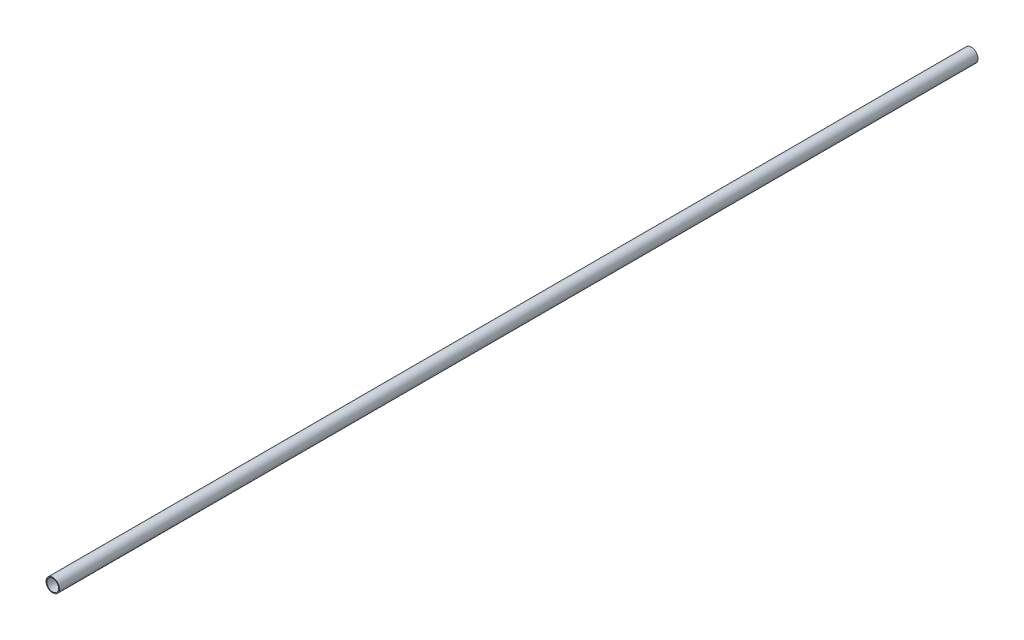
ISO-10303-21;
HEADER;
FILE_DESCRIPTION(('STEP AP214'),'2;1');
FILE_NAME('part.step','',(''),(''),'','','');
FILE_SCHEMA(('AUTOMOTIVE_DESIGN { 1 0 10303 214 1 1 1 1 }'));
ENDSEC;
DATA;
#1=APPLICATION_CONTEXT('core data for automotive mechanical design processes');
#2=APPLICATION_PROTOCOL_DEFINITION('international standard','automotive_design',2000,#1);
#3=PRODUCT_CONTEXT('',#1,'mechanical');
#4=PRODUCT('Part','Part','',(#3));
#5=PRODUCT_RELATED_PRODUCT_CATEGORY('part','',(#4));
#6=PRODUCT_DEFINITION_FORMATION('','',#4);
#7=PRODUCT_DEFINITION_CONTEXT('part definition',#1,'design');
#8=PRODUCT_DEFINITION('design','',#6,#7);
#9=PRODUCT_DEFINITION_SHAPE('','',#8);
#10=(LENGTH_UNIT() NAMED_UNIT(*) SI_UNIT(.MILLI.,.METRE.));
#11=(NAMED_UNIT(*) PLANE_ANGLE_UNIT() SI_UNIT($,.RADIAN.));
#12=(NAMED_UNIT(*) SI_UNIT($,.STERADIAN.) SOLID_ANGLE_UNIT());
#13=UNCERTAINTY_MEASURE_WITH_UNIT(LENGTH_MEASURE(1.E-05),#10,'distance_accuracy_value','');
#14=(GEOMETRIC_REPRESENTATION_CONTEXT(3) GLOBAL_UNCERTAINTY_ASSIGNED_CONTEXT((#13)) GLOBAL_UNIT_ASSIGNED_CONTEXT((#10,
#11,#12)) REPRESENTATION_CONTEXT('',''));
#15=CARTESIAN_POINT('',(0.,0.,0.));
#16=DIRECTION('',(0.,0.,1.));
#17=DIRECTION('',(1.,0.,0.));
#18=AXIS2_PLACEMENT_3D('',#15,#16,#17);
#19=CARTESIAN_POINT('',(0.,0.,-742.95));
#20=DIRECTION('',(0.,0.,-1.));
#21=DIRECTION('',(1.,0.,0.));
#22=AXIS2_PLACEMENT_3D('',#19,#20,#21);
#23=PLANE('',#22);
#24=CARTESIAN_POINT('',(0.,0.,-742.95));
#25=DIRECTION('',(0.,0.,1.));
#26=DIRECTION('',(1.,0.,0.));
#27=AXIS2_PLACEMENT_3D('',#24,#25,#26);
#28=CIRCLE('',#27,10.922);
#29=CARTESIAN_POINT('',(10.922,0.,-742.95));
#30=VERTEX_POINT('',#29);
#31=EDGE_CURVE('E10',#30,#30,#28,.T.);
#32=ORIENTED_EDGE('',*,*,#31,.F.);
#33=EDGE_LOOP('',(#32));
#34=FACE_BOUND('',#33,.T.);
#35=CARTESIAN_POINT('',(0.,0.,-742.95));
#36=DIRECTION('',(0.,0.,1.));
#37=DIRECTION('',(1.,0.,0.));
#38=AXIS2_PLACEMENT_3D('',#35,#36,#37);
#39=CIRCLE('',#38,9.525);
#40=CARTESIAN_POINT('',(9.525,0.,-742.95));
#41=VERTEX_POINT('',#40);
#42=EDGE_CURVE('E48',#41,#41,#39,.T.);
#43=ORIENTED_EDGE('',*,*,#42,.T.);
#44=EDGE_LOOP('',(#43));
#45=FACE_BOUND('',#44,.T.);
#46=ADVANCED_FACE('F41',(#34,#45),#23,.T.);
#47=CARTESIAN_POINT('',(0.,0.,-742.95));
#48=DIRECTION('',(0.,0.,1.));
#49=DIRECTION('',(-1.,0.,0.));
#50=AXIS2_PLACEMENT_3D('',#47,#48,#49);
#51=CYLINDRICAL_SURFACE('',#50,10.922);
#52=ORIENTED_EDGE('',*,*,#31,.T.);
#53=EDGE_LOOP('',(#52));
#54=FACE_BOUND('',#53,.T.);
#55=CARTESIAN_POINT('',(0.,0.,742.95));
#56=DIRECTION('',(0.,0.,1.));
#57=DIRECTION('',(1.,0.,0.));
#58=AXIS2_PLACEMENT_3D('',#55,#56,#57);
#59=CIRCLE('',#58,10.922);
#60=CARTESIAN_POINT('',(10.922,0.,742.95));
#61=VERTEX_POINT('',#60);
#62=EDGE_CURVE('E52',#61,#61,#59,.T.);
#63=ORIENTED_EDGE('',*,*,#62,.F.);
#64=EDGE_LOOP('',(#63));
#65=FACE_BOUND('',#64,.T.);
#66=ADVANCED_FACE('F43',(#54,#65),#51,.T.);
#67=CARTESIAN_POINT('',(0.,0.,-742.95));
#68=DIRECTION('',(0.,0.,1.));
#69=DIRECTION('',(-1.,0.,0.));
#70=AXIS2_PLACEMENT_3D('',#67,#68,#69);
#71=CYLINDRICAL_SURFACE('',#70,9.525);
#72=ORIENTED_EDGE('',*,*,#42,.F.);
#73=EDGE_LOOP('',(#72));
#74=FACE_BOUND('',#73,.T.);
#75=CARTESIAN_POINT('',(0.,0.,742.95));
#76=DIRECTION('',(0.,0.,1.));
#77=DIRECTION('',(1.,0.,0.));
#78=AXIS2_PLACEMENT_3D('',#75,#76,#77);
#79=CIRCLE('',#78,9.525);
#80=CARTESIAN_POINT('',(9.525,0.,742.95));
#81=VERTEX_POINT('',#80);
#82=EDGE_CURVE('E56',#81,#81,#79,.T.);
#83=ORIENTED_EDGE('',*,*,#82,.T.);
#84=EDGE_LOOP('',(#83));
#85=FACE_BOUND('',#84,.T.);
#86=ADVANCED_FACE('F62',(#74,#85),#71,.F.);
#87=CARTESIAN_POINT('',(0.,0.,742.95));
#88=DIRECTION('',(0.,0.,-1.));
#89=DIRECTION('',(1.,0.,0.));
#90=AXIS2_PLACEMENT_3D('',#87,#88,#89);
#91=PLANE('',#90);
#92=ORIENTED_EDGE('',*,*,#82,.F.);
#93=EDGE_LOOP('',(#92));
#94=FACE_BOUND('',#93,.T.);
#95=ORIENTED_EDGE('',*,*,#62,.T.);
#96=EDGE_LOOP('',(#95));
#97=FACE_BOUND('',#96,.T.);
#98=ADVANCED_FACE('F64',(#94,#97),#91,.F.);
#99=CLOSED_SHELL('',(#46,#66,#86,#98));
#100=MANIFOLD_SOLID_BREP('B2',#99);
#101=ADVANCED_BREP_SHAPE_REPRESENTATION('',(#18,#100),#14);
#102=SHAPE_DEFINITION_REPRESENTATION(#9,#101);
ENDSEC;
END-ISO-10303-21;
